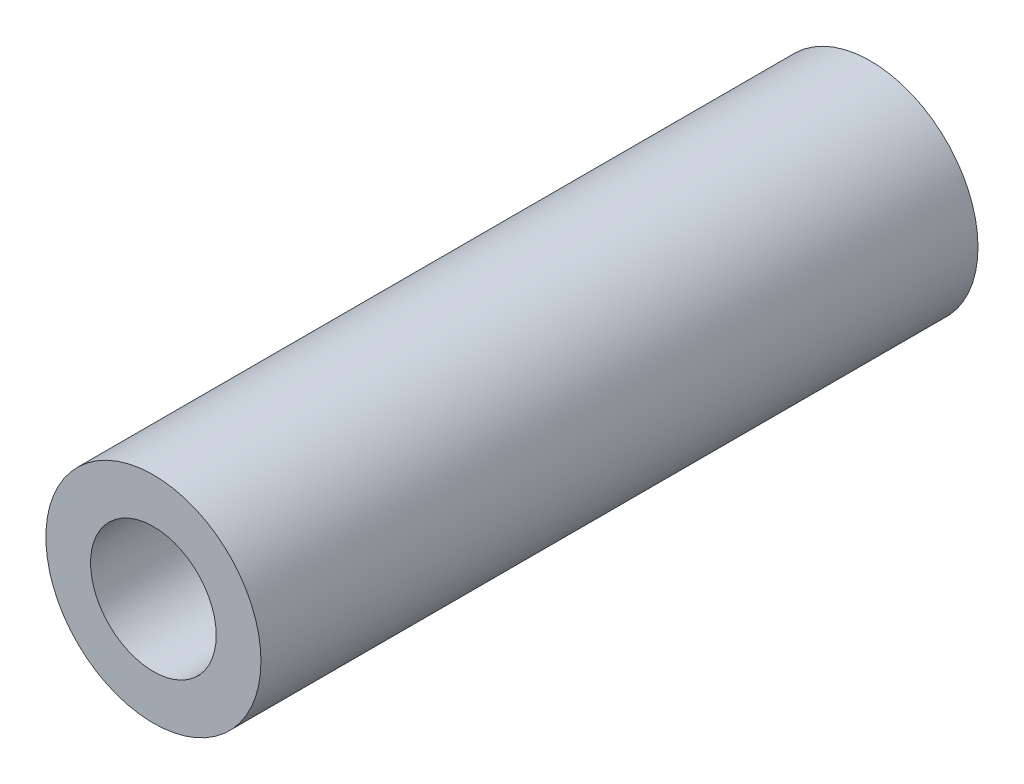
ISO-10303-21;
HEADER;
FILE_DESCRIPTION(('STEP AP214'),'2;1');
FILE_NAME('part.step','',(''),(''),'','','');
FILE_SCHEMA(('AUTOMOTIVE_DESIGN { 1 0 10303 214 1 1 1 1 }'));
ENDSEC;
DATA;
#1=APPLICATION_CONTEXT('core data for automotive mechanical design processes');
#2=APPLICATION_PROTOCOL_DEFINITION('international standard','automotive_design',2000,#1);
#3=PRODUCT_CONTEXT('',#1,'mechanical');
#4=PRODUCT('Part','Part','',(#3));
#5=PRODUCT_RELATED_PRODUCT_CATEGORY('part','',(#4));
#6=PRODUCT_DEFINITION_FORMATION('','',#4);
#7=PRODUCT_DEFINITION_CONTEXT('part definition',#1,'design');
#8=PRODUCT_DEFINITION('design','',#6,#7);
#9=PRODUCT_DEFINITION_SHAPE('','',#8);
#10=(LENGTH_UNIT() NAMED_UNIT(*) SI_UNIT(.MILLI.,.METRE.));
#11=(NAMED_UNIT(*) PLANE_ANGLE_UNIT() SI_UNIT($,.RADIAN.));
#12=(NAMED_UNIT(*) SI_UNIT($,.STERADIAN.) SOLID_ANGLE_UNIT());
#13=UNCERTAINTY_MEASURE_WITH_UNIT(LENGTH_MEASURE(1.E-05),#10,'distance_accuracy_value','');
#14=(GEOMETRIC_REPRESENTATION_CONTEXT(3) GLOBAL_UNCERTAINTY_ASSIGNED_CONTEXT((#13)) GLOBAL_UNIT_ASSIGNED_CONTEXT((#10,
#11,#12)) REPRESENTATION_CONTEXT('',''));
#15=CARTESIAN_POINT('',(0.,0.,0.));
#16=DIRECTION('',(0.,0.,1.));
#17=DIRECTION('',(1.,0.,0.));
#18=AXIS2_PLACEMENT_3D('',#15,#16,#17);
#19=CARTESIAN_POINT('',(0.,0.,0.));
#20=DIRECTION('',(0.,0.,1.));
#21=DIRECTION('',(1.,0.,0.));
#22=AXIS2_PLACEMENT_3D('',#19,#20,#21);
#23=CYLINDRICAL_SURFACE('',#22,2.7813);
#24=CARTESIAN_POINT('',(0.,0.,0.));
#25=DIRECTION('',(0.,0.,1.));
#26=DIRECTION('',(1.,0.,0.));
#27=AXIS2_PLACEMENT_3D('',#24,#25,#26);
#28=CIRCLE('',#27,2.7813);
#29=CARTESIAN_POINT('',(2.7813,0.,0.));
#30=VERTEX_POINT('',#29);
#31=EDGE_CURVE('E26',#30,#30,#28,.F.);
#32=ORIENTED_EDGE('',*,*,#31,.T.);
#33=EDGE_LOOP('',(#32));
#34=FACE_BOUND('',#33,.T.);
#35=CARTESIAN_POINT('',(0.,0.,31.75));
#36=DIRECTION('',(0.,0.,1.));
#37=DIRECTION('',(1.,0.,0.));
#38=AXIS2_PLACEMENT_3D('',#35,#36,#37);
#39=CIRCLE('',#38,2.7813);
#40=CARTESIAN_POINT('',(2.7813,0.,31.75));
#41=VERTEX_POINT('',#40);
#42=EDGE_CURVE('E17',#41,#41,#39,.F.);
#43=ORIENTED_EDGE('',*,*,#42,.F.);
#44=EDGE_LOOP('',(#43));
#45=FACE_BOUND('',#44,.T.);
#46=ADVANCED_FACE('F14',(#34,#45),#23,.F.);
#47=CARTESIAN_POINT('',(0.,0.,31.75));
#48=DIRECTION('',(0.,0.,1.));
#49=DIRECTION('',(1.,0.,0.));
#50=AXIS2_PLACEMENT_3D('',#47,#48,#49);
#51=PLANE('',#50);
#52=CARTESIAN_POINT('',(0.,0.,31.75));
#53=DIRECTION('',(0.,0.,1.));
#54=DIRECTION('',(1.,0.,0.));
#55=AXIS2_PLACEMENT_3D('',#52,#53,#54);
#56=CIRCLE('',#55,4.7625);
#57=CARTESIAN_POINT('',(4.7625,0.,31.75));
#58=VERTEX_POINT('',#57);
#59=EDGE_CURVE('E21',#58,#58,#56,.F.);
#60=ORIENTED_EDGE('',*,*,#59,.F.);
#61=EDGE_LOOP('',(#60));
#62=FACE_BOUND('',#61,.T.);
#63=ORIENTED_EDGE('',*,*,#42,.T.);
#64=EDGE_LOOP('',(#63));
#65=FACE_BOUND('',#64,.T.);
#66=ADVANCED_FACE('F34',(#62,#65),#51,.T.);
#67=CARTESIAN_POINT('',(0.,0.,0.));
#68=DIRECTION('',(0.,0.,1.));
#69=DIRECTION('',(1.,0.,0.));
#70=AXIS2_PLACEMENT_3D('',#67,#68,#69);
#71=PLANE('',#70);
#72=CARTESIAN_POINT('',(0.,0.,0.));
#73=DIRECTION('',(0.,0.,1.));
#74=DIRECTION('',(1.,0.,0.));
#75=AXIS2_PLACEMENT_3D('',#72,#73,#74);
#76=CIRCLE('',#75,4.7625);
#77=CARTESIAN_POINT('',(4.7625,0.,0.));
#78=VERTEX_POINT('',#77);
#79=EDGE_CURVE('E10',#78,#78,#76,.T.);
#80=ORIENTED_EDGE('',*,*,#79,.F.);
#81=EDGE_LOOP('',(#80));
#82=FACE_BOUND('',#81,.T.);
#83=ORIENTED_EDGE('',*,*,#31,.F.);
#84=EDGE_LOOP('',(#83));
#85=FACE_BOUND('',#84,.T.);
#86=ADVANCED_FACE('F41',(#82,#85),#71,.F.);
#87=CARTESIAN_POINT('',(0.,0.,0.));
#88=DIRECTION('',(0.,0.,1.));
#89=DIRECTION('',(1.,0.,0.));
#90=AXIS2_PLACEMENT_3D('',#87,#88,#89);
#91=CYLINDRICAL_SURFACE('',#90,4.7625);
#92=ORIENTED_EDGE('',*,*,#79,.T.);
#93=EDGE_LOOP('',(#92));
#94=FACE_BOUND('',#93,.T.);
#95=ORIENTED_EDGE('',*,*,#59,.T.);
#96=EDGE_LOOP('',(#95));
#97=FACE_BOUND('',#96,.T.);
#98=ADVANCED_FACE('F43',(#94,#97),#91,.T.);
#99=CLOSED_SHELL('',(#46,#66,#86,#98));
#100=MANIFOLD_SOLID_BREP('B1',#99);
#101=ADVANCED_BREP_SHAPE_REPRESENTATION('',(#18,#100),#14);
#102=SHAPE_DEFINITION_REPRESENTATION(#9,#101);
ENDSEC;
END-ISO-10303-21;
